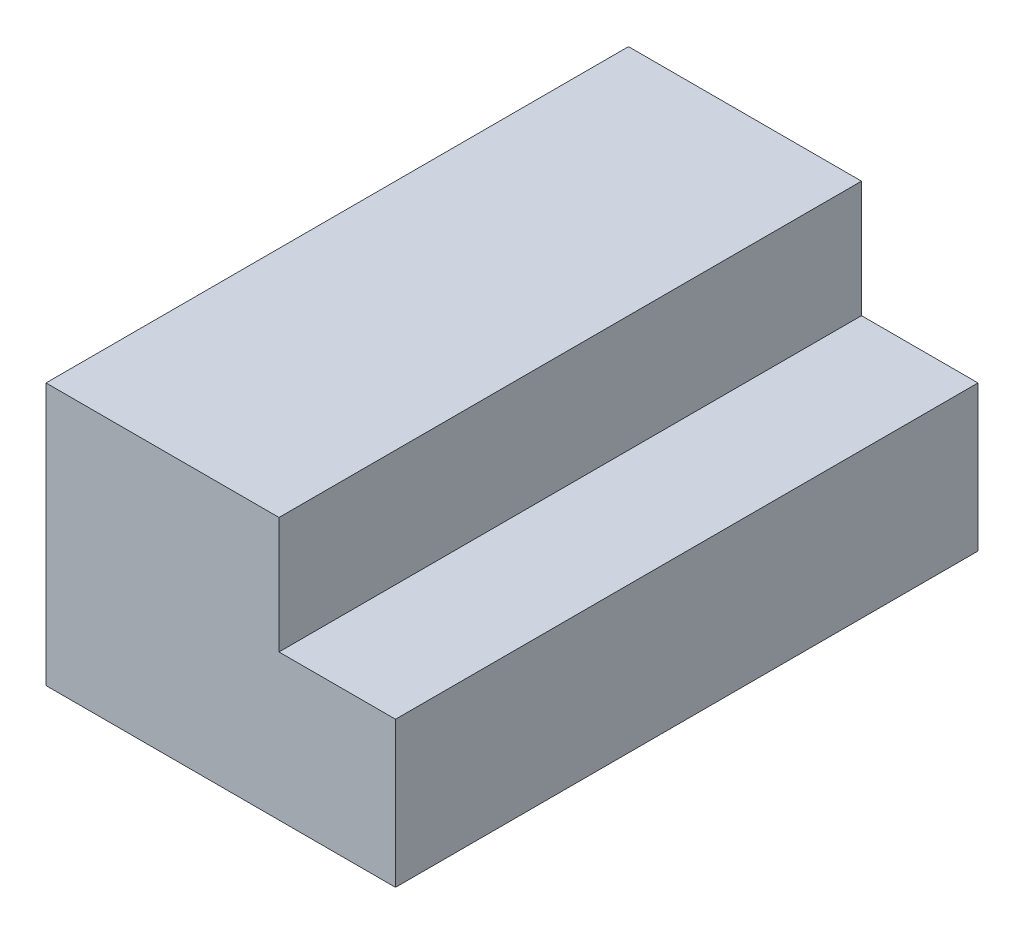
ISO-10303-21;
HEADER;
FILE_DESCRIPTION(('STEP AP214'),'2;1');
FILE_NAME('part.step','',(''),(''),'','','');
FILE_SCHEMA(('AUTOMOTIVE_DESIGN { 1 0 10303 214 1 1 1 1 }'));
ENDSEC;
DATA;
#1=APPLICATION_CONTEXT('core data for automotive mechanical design processes');
#2=APPLICATION_PROTOCOL_DEFINITION('international standard','automotive_design',2000,#1);
#3=PRODUCT_CONTEXT('',#1,'mechanical');
#4=PRODUCT('Part','Part','',(#3));
#5=PRODUCT_RELATED_PRODUCT_CATEGORY('part','',(#4));
#6=PRODUCT_DEFINITION_FORMATION('','',#4);
#7=PRODUCT_DEFINITION_CONTEXT('part definition',#1,'design');
#8=PRODUCT_DEFINITION('design','',#6,#7);
#9=PRODUCT_DEFINITION_SHAPE('','',#8);
#10=(LENGTH_UNIT() NAMED_UNIT(*) SI_UNIT(.MILLI.,.METRE.));
#11=(NAMED_UNIT(*) PLANE_ANGLE_UNIT() SI_UNIT($,.RADIAN.));
#12=(NAMED_UNIT(*) SI_UNIT($,.STERADIAN.) SOLID_ANGLE_UNIT());
#13=UNCERTAINTY_MEASURE_WITH_UNIT(LENGTH_MEASURE(1.E-05),#10,'distance_accuracy_value','');
#14=(GEOMETRIC_REPRESENTATION_CONTEXT(3) GLOBAL_UNCERTAINTY_ASSIGNED_CONTEXT((#13)) GLOBAL_UNIT_ASSIGNED_CONTEXT((#10,
#11,#12)) REPRESENTATION_CONTEXT('',''));
#15=CARTESIAN_POINT('',(0.,0.,0.));
#16=DIRECTION('',(0.,0.,1.));
#17=DIRECTION('',(1.,0.,0.));
#18=AXIS2_PLACEMENT_3D('',#15,#16,#17);
#19=CARTESIAN_POINT('',(-2.,-1.25,5.));
#20=DIRECTION('',(1.,0.,0.));
#21=DIRECTION('',(0.,0.,-1.));
#22=AXIS2_PLACEMENT_3D('',#19,#20,#21);
#23=PLANE('',#22);
#24=DIRECTION('',(0.,-1.,0.));
#25=VECTOR('',#24,1.);
#26=CARTESIAN_POINT('',(-2.,-1.25,0.));
#27=LINE('',#26,#25);
#28=CARTESIAN_POINT('',(-2.,1.,0.));
#29=VERTEX_POINT('',#28);
#30=CARTESIAN_POINT('',(-2.,-1.25,0.));
#31=VERTEX_POINT('',#30);
#32=EDGE_CURVE('E128',#29,#31,#27,.T.);
#33=ORIENTED_EDGE('',*,*,#32,.T.);
#34=DIRECTION('',(0.,0.,-1.));
#35=VECTOR('',#34,1.);
#36=CARTESIAN_POINT('',(-2.,-1.25,5.));
#37=LINE('',#36,#35);
#38=CARTESIAN_POINT('',(-2.,-1.25,5.));
#39=VERTEX_POINT('',#38);
#40=EDGE_CURVE('E11',#39,#31,#37,.T.);
#41=ORIENTED_EDGE('',*,*,#40,.F.);
#42=DIRECTION('',(0.,-1.,0.));
#43=VECTOR('',#42,1.);
#44=CARTESIAN_POINT('',(-2.,-1.25,5.));
#45=LINE('',#44,#43);
#46=CARTESIAN_POINT('',(-2.,1.,5.));
#47=VERTEX_POINT('',#46);
#48=EDGE_CURVE('E144',#47,#39,#45,.T.);
#49=ORIENTED_EDGE('',*,*,#48,.F.);
#50=DIRECTION('',(0.,0.,-1.));
#51=VECTOR('',#50,1.);
#52=CARTESIAN_POINT('',(-2.,1.,5.));
#53=LINE('',#52,#51);
#54=EDGE_CURVE('E124',#47,#29,#53,.T.);
#55=ORIENTED_EDGE('',*,*,#54,.T.);
#56=EDGE_LOOP('',(#33,#41,#49,#55));
#57=FACE_BOUND('',#56,.T.);
#58=ADVANCED_FACE('F39',(#57),#23,.F.);
#59=CARTESIAN_POINT('',(1.,-1.25,5.));
#60=DIRECTION('',(0.,1.,0.));
#61=DIRECTION('',(-1.,0.,0.));
#62=AXIS2_PLACEMENT_3D('',#59,#60,#61);
#63=PLANE('',#62);
#64=DIRECTION('',(1.,0.,0.));
#65=VECTOR('',#64,1.);
#66=CARTESIAN_POINT('',(1.,-1.25,0.));
#67=LINE('',#66,#65);
#68=CARTESIAN_POINT('',(1.,-1.25,0.));
#69=VERTEX_POINT('',#68);
#70=EDGE_CURVE('E132',#31,#69,#67,.T.);
#71=ORIENTED_EDGE('',*,*,#70,.T.);
#72=DIRECTION('',(0.,0.,-1.));
#73=VECTOR('',#72,1.);
#74=CARTESIAN_POINT('',(1.,-1.25,5.));
#75=LINE('',#74,#73);
#76=CARTESIAN_POINT('',(1.,-1.25,5.));
#77=VERTEX_POINT('',#76);
#78=EDGE_CURVE('E48',#77,#69,#75,.T.);
#79=ORIENTED_EDGE('',*,*,#78,.F.);
#80=DIRECTION('',(1.,0.,0.));
#81=VECTOR('',#80,1.);
#82=CARTESIAN_POINT('',(1.,-1.25,5.));
#83=LINE('',#82,#81);
#84=EDGE_CURVE('E93',#39,#77,#83,.T.);
#85=ORIENTED_EDGE('',*,*,#84,.F.);
#86=ORIENTED_EDGE('',*,*,#40,.T.);
#87=EDGE_LOOP('',(#71,#79,#85,#86));
#88=FACE_BOUND('',#87,.T.);
#89=ADVANCED_FACE('F172',(#88),#63,.F.);
#90=CARTESIAN_POINT('',(1.,0.,5.));
#91=DIRECTION('',(-1.,0.,0.));
#92=DIRECTION('',(0.,-1.,0.));
#93=AXIS2_PLACEMENT_3D('',#90,#91,#92);
#94=PLANE('',#93);
#95=DIRECTION('',(0.,1.,0.));
#96=VECTOR('',#95,1.);
#97=CARTESIAN_POINT('',(1.,0.,0.));
#98=LINE('',#97,#96);
#99=CARTESIAN_POINT('',(1.,0.,0.));
#100=VERTEX_POINT('',#99);
#101=EDGE_CURVE('E135',#69,#100,#98,.T.);
#102=ORIENTED_EDGE('',*,*,#101,.T.);
#103=DIRECTION('',(0.,0.,-1.));
#104=VECTOR('',#103,1.);
#105=CARTESIAN_POINT('',(1.,0.,5.));
#106=LINE('',#105,#104);
#107=CARTESIAN_POINT('',(1.,0.,5.));
#108=VERTEX_POINT('',#107);
#109=EDGE_CURVE('E117',#108,#100,#106,.T.);
#110=ORIENTED_EDGE('',*,*,#109,.F.);
#111=DIRECTION('',(0.,1.,0.));
#112=VECTOR('',#111,1.);
#113=CARTESIAN_POINT('',(1.,0.,5.));
#114=LINE('',#113,#112);
#115=EDGE_CURVE('E106',#77,#108,#114,.T.);
#116=ORIENTED_EDGE('',*,*,#115,.F.);
#117=ORIENTED_EDGE('',*,*,#78,.T.);
#118=EDGE_LOOP('',(#102,#110,#116,#117));
#119=FACE_BOUND('',#118,.T.);
#120=ADVANCED_FACE('F154',(#119),#94,.F.);
#121=CARTESIAN_POINT('',(0.,0.,5.));
#122=DIRECTION('',(0.,-1.,0.));
#123=DIRECTION('',(0.,0.,-1.));
#124=AXIS2_PLACEMENT_3D('',#121,#122,#123);
#125=PLANE('',#124);
#126=DIRECTION('',(-1.,0.,0.));
#127=VECTOR('',#126,1.);
#128=CARTESIAN_POINT('',(0.,0.,0.));
#129=LINE('',#128,#127);
#130=CARTESIAN_POINT('',(0.,0.,0.));
#131=VERTEX_POINT('',#130);
#132=EDGE_CURVE('E115',#100,#131,#129,.T.);
#133=ORIENTED_EDGE('',*,*,#132,.T.);
#134=DIRECTION('',(0.,0.,-1.));
#135=VECTOR('',#134,1.);
#136=CARTESIAN_POINT('',(0.,0.,5.));
#137=LINE('',#136,#135);
#138=CARTESIAN_POINT('',(0.,0.,5.));
#139=VERTEX_POINT('',#138);
#140=EDGE_CURVE('E112',#139,#131,#137,.T.);
#141=ORIENTED_EDGE('',*,*,#140,.F.);
#142=DIRECTION('',(-1.,0.,0.));
#143=VECTOR('',#142,1.);
#144=CARTESIAN_POINT('',(0.,0.,5.));
#145=LINE('',#144,#143);
#146=EDGE_CURVE('E100',#108,#139,#145,.T.);
#147=ORIENTED_EDGE('',*,*,#146,.F.);
#148=ORIENTED_EDGE('',*,*,#109,.T.);
#149=EDGE_LOOP('',(#133,#141,#147,#148));
#150=FACE_BOUND('',#149,.T.);
#151=ADVANCED_FACE('F113',(#150),#125,.F.);
#152=CARTESIAN_POINT('',(0.,1.,5.));
#153=DIRECTION('',(-1.,0.,0.));
#154=DIRECTION('',(0.,-1.,0.));
#155=AXIS2_PLACEMENT_3D('',#152,#153,#154);
#156=PLANE('',#155);
#157=DIRECTION('',(0.,1.,0.));
#158=VECTOR('',#157,1.);
#159=CARTESIAN_POINT('',(0.,1.,0.));
#160=LINE('',#159,#158);
#161=CARTESIAN_POINT('',(0.,1.,0.));
#162=VERTEX_POINT('',#161);
#163=EDGE_CURVE('E79',#131,#162,#160,.T.);
#164=ORIENTED_EDGE('',*,*,#163,.T.);
#165=DIRECTION('',(0.,0.,-1.));
#166=VECTOR('',#165,1.);
#167=CARTESIAN_POINT('',(0.,1.,5.));
#168=LINE('',#167,#166);
#169=CARTESIAN_POINT('',(0.,1.,5.));
#170=VERTEX_POINT('',#169);
#171=EDGE_CURVE('E118',#170,#162,#168,.T.);
#172=ORIENTED_EDGE('',*,*,#171,.F.);
#173=DIRECTION('',(0.,1.,0.));
#174=VECTOR('',#173,1.);
#175=CARTESIAN_POINT('',(0.,1.,5.));
#176=LINE('',#175,#174);
#177=EDGE_CURVE('E104',#139,#170,#176,.T.);
#178=ORIENTED_EDGE('',*,*,#177,.F.);
#179=ORIENTED_EDGE('',*,*,#140,.T.);
#180=EDGE_LOOP('',(#164,#172,#178,#179));
#181=FACE_BOUND('',#180,.T.);
#182=ADVANCED_FACE('F120',(#181),#156,.F.);
#183=CARTESIAN_POINT('',(-2.,1.,5.));
#184=DIRECTION('',(0.,-1.,0.));
#185=DIRECTION('',(0.,0.,-1.));
#186=AXIS2_PLACEMENT_3D('',#183,#184,#185);
#187=PLANE('',#186);
#188=DIRECTION('',(-1.,0.,0.));
#189=VECTOR('',#188,1.);
#190=CARTESIAN_POINT('',(-2.,1.,0.));
#191=LINE('',#190,#189);
#192=EDGE_CURVE('E85',#162,#29,#191,.T.);
#193=ORIENTED_EDGE('',*,*,#192,.T.);
#194=ORIENTED_EDGE('',*,*,#54,.F.);
#195=DIRECTION('',(-1.,0.,0.));
#196=VECTOR('',#195,1.);
#197=CARTESIAN_POINT('',(-2.,1.,5.));
#198=LINE('',#197,#196);
#199=EDGE_CURVE('E56',#170,#47,#198,.T.);
#200=ORIENTED_EDGE('',*,*,#199,.F.);
#201=ORIENTED_EDGE('',*,*,#171,.T.);
#202=EDGE_LOOP('',(#193,#194,#200,#201));
#203=FACE_BOUND('',#202,.T.);
#204=ADVANCED_FACE('F161',(#203),#187,.F.);
#205=CARTESIAN_POINT('',(0.,0.,5.));
#206=DIRECTION('',(0.,0.,-1.));
#207=DIRECTION('',(-1.,0.,0.));
#208=AXIS2_PLACEMENT_3D('',#205,#206,#207);
#209=PLANE('',#208);
#210=ORIENTED_EDGE('',*,*,#48,.T.);
#211=ORIENTED_EDGE('',*,*,#84,.T.);
#212=ORIENTED_EDGE('',*,*,#115,.T.);
#213=ORIENTED_EDGE('',*,*,#146,.T.);
#214=ORIENTED_EDGE('',*,*,#177,.T.);
#215=ORIENTED_EDGE('',*,*,#199,.T.);
#216=EDGE_LOOP('',(#210,#211,#212,#213,#214,#215));
#217=FACE_BOUND('',#216,.T.);
#218=ADVANCED_FACE('F102',(#217),#209,.F.);
#219=CARTESIAN_POINT('',(0.,0.,0.));
#220=DIRECTION('',(0.,0.,-1.));
#221=DIRECTION('',(-1.,0.,0.));
#222=AXIS2_PLACEMENT_3D('',#219,#220,#221);
#223=PLANE('',#222);
#224=ORIENTED_EDGE('',*,*,#32,.F.);
#225=ORIENTED_EDGE('',*,*,#192,.F.);
#226=ORIENTED_EDGE('',*,*,#163,.F.);
#227=ORIENTED_EDGE('',*,*,#132,.F.);
#228=ORIENTED_EDGE('',*,*,#101,.F.);
#229=ORIENTED_EDGE('',*,*,#70,.F.);
#230=EDGE_LOOP('',(#224,#225,#226,#227,#228,#229));
#231=FACE_BOUND('',#230,.T.);
#232=ADVANCED_FACE('F157',(#231),#223,.T.);
#233=CLOSED_SHELL('',(#58,#89,#120,#151,#182,#204,#218,#232));
#234=MANIFOLD_SOLID_BREP('B2',#233);
#235=ADVANCED_BREP_SHAPE_REPRESENTATION('',(#18,#234),#14);
#236=SHAPE_DEFINITION_REPRESENTATION(#9,#235);
ENDSEC;
END-ISO-10303-21;
